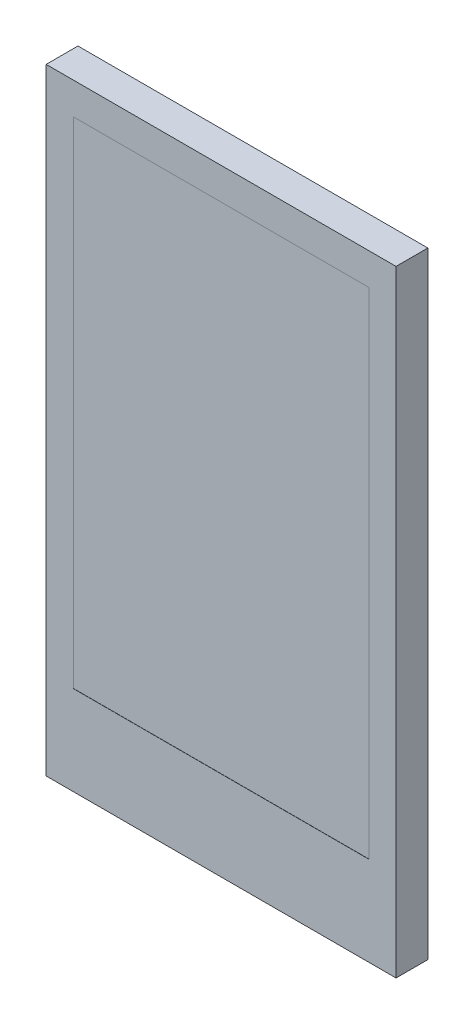
ISO-10303-21;
HEADER;
FILE_DESCRIPTION(('STEP AP214'),'2;1');
FILE_NAME('part.step','',(''),(''),'','','');
FILE_SCHEMA(('AUTOMOTIVE_DESIGN { 1 0 10303 214 1 1 1 1 }'));
ENDSEC;
DATA;
#1=APPLICATION_CONTEXT('core data for automotive mechanical design processes');
#2=APPLICATION_PROTOCOL_DEFINITION('international standard','automotive_design',2000,#1);
#3=PRODUCT_CONTEXT('',#1,'mechanical');
#4=PRODUCT('Part','Part','',(#3));
#5=PRODUCT_RELATED_PRODUCT_CATEGORY('part','',(#4));
#6=PRODUCT_DEFINITION_FORMATION('','',#4);
#7=PRODUCT_DEFINITION_CONTEXT('part definition',#1,'design');
#8=PRODUCT_DEFINITION('design','',#6,#7);
#9=PRODUCT_DEFINITION_SHAPE('','',#8);
#10=(LENGTH_UNIT() NAMED_UNIT(*) SI_UNIT(.MILLI.,.METRE.));
#11=(NAMED_UNIT(*) PLANE_ANGLE_UNIT() SI_UNIT($,.RADIAN.));
#12=(NAMED_UNIT(*) SI_UNIT($,.STERADIAN.) SOLID_ANGLE_UNIT());
#13=UNCERTAINTY_MEASURE_WITH_UNIT(LENGTH_MEASURE(1.E-05),#10,'distance_accuracy_value','');
#14=(GEOMETRIC_REPRESENTATION_CONTEXT(3) GLOBAL_UNCERTAINTY_ASSIGNED_CONTEXT((#13)) GLOBAL_UNIT_ASSIGNED_CONTEXT((#10,
#11,#12)) REPRESENTATION_CONTEXT('',''));
#15=CARTESIAN_POINT('',(0.,0.,0.));
#16=DIRECTION('',(0.,0.,1.));
#17=DIRECTION('',(1.,0.,0.));
#18=AXIS2_PLACEMENT_3D('',#15,#16,#17);
#19=CARTESIAN_POINT('',(-8.8,-15.5,1.6));
#20=DIRECTION('',(1.,0.,0.));
#21=DIRECTION('',(0.,0.,-1.));
#22=AXIS2_PLACEMENT_3D('',#19,#20,#21);
#23=PLANE('',#22);
#24=DIRECTION('',(0.,-1.,0.));
#25=VECTOR('',#24,1.);
#26=CARTESIAN_POINT('',(-8.8,-15.5,0.));
#27=LINE('',#26,#25);
#28=CARTESIAN_POINT('',(-8.8,15.5,0.));
#29=VERTEX_POINT('',#28);
#30=CARTESIAN_POINT('',(-8.8,-15.5,0.));
#31=VERTEX_POINT('',#30);
#32=EDGE_CURVE('E160',#29,#31,#27,.T.);
#33=ORIENTED_EDGE('',*,*,#32,.T.);
#34=DIRECTION('',(0.,0.,-1.));
#35=VECTOR('',#34,1.);
#36=CARTESIAN_POINT('',(-8.8,-15.5,1.6));
#37=LINE('',#36,#35);
#38=CARTESIAN_POINT('',(-8.8,-15.5,1.6));
#39=VERTEX_POINT('',#38);
#40=EDGE_CURVE('E11',#39,#31,#37,.T.);
#41=ORIENTED_EDGE('',*,*,#40,.F.);
#42=DIRECTION('',(0.,-1.,0.));
#43=VECTOR('',#42,1.);
#44=CARTESIAN_POINT('',(-8.8,-15.5,1.6));
#45=LINE('',#44,#43);
#46=CARTESIAN_POINT('',(-8.8,15.5,1.6));
#47=VERTEX_POINT('',#46);
#48=EDGE_CURVE('E166',#47,#39,#45,.T.);
#49=ORIENTED_EDGE('',*,*,#48,.F.);
#50=DIRECTION('',(0.,0.,-1.));
#51=VECTOR('',#50,1.);
#52=CARTESIAN_POINT('',(-8.8,15.5,1.6));
#53=LINE('',#52,#51);
#54=EDGE_CURVE('E176',#47,#29,#53,.T.);
#55=ORIENTED_EDGE('',*,*,#54,.T.);
#56=EDGE_LOOP('',(#33,#41,#49,#55));
#57=FACE_BOUND('',#56,.T.);
#58=ADVANCED_FACE('F41',(#57),#23,.F.);
#59=CARTESIAN_POINT('',(8.8,-15.5,1.6));
#60=DIRECTION('',(0.,1.,0.));
#61=DIRECTION('',(0.,0.,1.));
#62=AXIS2_PLACEMENT_3D('',#59,#60,#61);
#63=PLANE('',#62);
#64=DIRECTION('',(1.,0.,0.));
#65=VECTOR('',#64,1.);
#66=CARTESIAN_POINT('',(8.8,-15.5,0.));
#67=LINE('',#66,#65);
#68=CARTESIAN_POINT('',(8.8,-15.5,0.));
#69=VERTEX_POINT('',#68);
#70=EDGE_CURVE('E180',#31,#69,#67,.T.);
#71=ORIENTED_EDGE('',*,*,#70,.T.);
#72=DIRECTION('',(0.,0.,-1.));
#73=VECTOR('',#72,1.);
#74=CARTESIAN_POINT('',(8.8,-15.5,1.6));
#75=LINE('',#74,#73);
#76=CARTESIAN_POINT('',(8.8,-15.5,1.6));
#77=VERTEX_POINT('',#76);
#78=EDGE_CURVE('E49',#77,#69,#75,.T.);
#79=ORIENTED_EDGE('',*,*,#78,.F.);
#80=DIRECTION('',(1.,0.,0.));
#81=VECTOR('',#80,1.);
#82=CARTESIAN_POINT('',(8.8,-15.5,1.6));
#83=LINE('',#82,#81);
#84=EDGE_CURVE('E93',#39,#77,#83,.T.);
#85=ORIENTED_EDGE('',*,*,#84,.F.);
#86=ORIENTED_EDGE('',*,*,#40,.T.);
#87=EDGE_LOOP('',(#71,#79,#85,#86));
#88=FACE_BOUND('',#87,.T.);
#89=ADVANCED_FACE('F215',(#88),#63,.F.);
#90=CARTESIAN_POINT('',(8.8,-15.5,1.6));
#91=DIRECTION('',(-1.,0.,0.));
#92=DIRECTION('',(0.,0.,1.));
#93=AXIS2_PLACEMENT_3D('',#90,#91,#92);
#94=PLANE('',#93);
#95=DIRECTION('',(0.,1.,0.));
#96=VECTOR('',#95,1.);
#97=CARTESIAN_POINT('',(8.8,-15.5,0.));
#98=LINE('',#97,#96);
#99=CARTESIAN_POINT('',(8.8,15.5,0.));
#100=VERTEX_POINT('',#99);
#101=EDGE_CURVE('E183',#69,#100,#98,.T.);
#102=ORIENTED_EDGE('',*,*,#101,.T.);
#103=DIRECTION('',(0.,0.,-1.));
#104=VECTOR('',#103,1.);
#105=CARTESIAN_POINT('',(8.8,15.5,1.6));
#106=LINE('',#105,#104);
#107=CARTESIAN_POINT('',(8.8,15.5,1.6));
#108=VERTEX_POINT('',#107);
#109=EDGE_CURVE('E190',#108,#100,#106,.T.);
#110=ORIENTED_EDGE('',*,*,#109,.F.);
#111=DIRECTION('',(0.,1.,0.));
#112=VECTOR('',#111,1.);
#113=CARTESIAN_POINT('',(8.8,-15.5,1.6));
#114=LINE('',#113,#112);
#115=EDGE_CURVE('E171',#77,#108,#114,.T.);
#116=ORIENTED_EDGE('',*,*,#115,.F.);
#117=ORIENTED_EDGE('',*,*,#78,.T.);
#118=EDGE_LOOP('',(#102,#110,#116,#117));
#119=FACE_BOUND('',#118,.T.);
#120=ADVANCED_FACE('F197',(#119),#94,.F.);
#121=CARTESIAN_POINT('',(8.8,15.5,1.6));
#122=DIRECTION('',(0.,-1.,0.));
#123=DIRECTION('',(1.,0.,0.));
#124=AXIS2_PLACEMENT_3D('',#121,#122,#123);
#125=PLANE('',#124);
#126=DIRECTION('',(-1.,0.,0.));
#127=VECTOR('',#126,1.);
#128=CARTESIAN_POINT('',(8.8,15.5,0.));
#129=LINE('',#128,#127);
#130=EDGE_CURVE('E86',#100,#29,#129,.T.);
#131=ORIENTED_EDGE('',*,*,#130,.T.);
#132=ORIENTED_EDGE('',*,*,#54,.F.);
#133=DIRECTION('',(-1.,0.,0.));
#134=VECTOR('',#133,1.);
#135=CARTESIAN_POINT('',(8.8,15.5,1.6));
#136=LINE('',#135,#134);
#137=EDGE_CURVE('E65',#108,#47,#136,.T.);
#138=ORIENTED_EDGE('',*,*,#137,.F.);
#139=ORIENTED_EDGE('',*,*,#109,.T.);
#140=EDGE_LOOP('',(#131,#132,#138,#139));
#141=FACE_BOUND('',#140,.T.);
#142=ADVANCED_FACE('F205',(#141),#125,.F.);
#143=CARTESIAN_POINT('',(0.,0.,1.6));
#144=DIRECTION('',(0.,0.,1.));
#145=DIRECTION('',(1.,0.,0.));
#146=AXIS2_PLACEMENT_3D('',#143,#144,#145);
#147=PLANE('',#146);
#148=DIRECTION('',(0.,-1.,0.));
#149=VECTOR('',#148,1.);
#150=CARTESIAN_POINT('',(-7.43,13.9,1.6));
#151=LINE('',#150,#149);
#152=CARTESIAN_POINT('',(-7.43,13.9,1.6));
#153=VERTEX_POINT('',#152);
#154=CARTESIAN_POINT('',(-7.43,-11.01,1.6));
#155=VERTEX_POINT('',#154);
#156=EDGE_CURVE('E56',#153,#155,#151,.T.);
#157=ORIENTED_EDGE('',*,*,#156,.F.);
#158=DIRECTION('',(-1.,0.,0.));
#159=VECTOR('',#158,1.);
#160=CARTESIAN_POINT('',(7.43,13.9,1.6));
#161=LINE('',#160,#159);
#162=CARTESIAN_POINT('',(7.43,13.9,1.6));
#163=VERTEX_POINT('',#162);
#164=EDGE_CURVE('E138',#163,#153,#161,.T.);
#165=ORIENTED_EDGE('',*,*,#164,.F.);
#166=DIRECTION('',(0.,1.,0.));
#167=VECTOR('',#166,1.);
#168=CARTESIAN_POINT('',(7.43,-11.01,1.6));
#169=LINE('',#168,#167);
#170=CARTESIAN_POINT('',(7.43,-11.01,1.6));
#171=VERTEX_POINT('',#170);
#172=EDGE_CURVE('E142',#171,#163,#169,.T.);
#173=ORIENTED_EDGE('',*,*,#172,.F.);
#174=DIRECTION('',(1.,0.,0.));
#175=VECTOR('',#174,1.);
#176=CARTESIAN_POINT('',(-7.43,-11.01,1.6));
#177=LINE('',#176,#175);
#178=EDGE_CURVE('E151',#155,#171,#177,.T.);
#179=ORIENTED_EDGE('',*,*,#178,.F.);
#180=EDGE_LOOP('',(#157,#165,#173,#179));
#181=FACE_BOUND('',#180,.T.);
#182=ORIENTED_EDGE('',*,*,#48,.T.);
#183=ORIENTED_EDGE('',*,*,#84,.T.);
#184=ORIENTED_EDGE('',*,*,#115,.T.);
#185=ORIENTED_EDGE('',*,*,#137,.T.);
#186=EDGE_LOOP('',(#182,#183,#184,#185));
#187=FACE_BOUND('',#186,.T.);
#188=ADVANCED_FACE('F207',(#181,#187),#147,.T.);
#189=CARTESIAN_POINT('',(0.,0.,0.));
#190=DIRECTION('',(0.,0.,1.));
#191=DIRECTION('',(1.,0.,0.));
#192=AXIS2_PLACEMENT_3D('',#189,#190,#191);
#193=PLANE('',#192);
#194=ORIENTED_EDGE('',*,*,#32,.F.);
#195=ORIENTED_EDGE('',*,*,#130,.F.);
#196=ORIENTED_EDGE('',*,*,#101,.F.);
#197=ORIENTED_EDGE('',*,*,#70,.F.);
#198=EDGE_LOOP('',(#194,#195,#196,#197));
#199=FACE_BOUND('',#198,.T.);
#200=ADVANCED_FACE('F201',(#199),#193,.F.);
#201=CARTESIAN_POINT('',(-7.43,13.9,1.59));
#202=DIRECTION('',(-1.,0.,0.));
#203=DIRECTION('',(0.,-1.,0.));
#204=AXIS2_PLACEMENT_3D('',#201,#202,#203);
#205=PLANE('',#204);
#206=ORIENTED_EDGE('',*,*,#156,.T.);
#207=DIRECTION('',(0.,0.,1.));
#208=VECTOR('',#207,1.);
#209=CARTESIAN_POINT('',(-7.43,-11.01,1.59));
#210=LINE('',#209,#208);
#211=CARTESIAN_POINT('',(-7.43,-11.01,1.59));
#212=VERTEX_POINT('',#211);
#213=EDGE_CURVE('E113',#212,#155,#210,.T.);
#214=ORIENTED_EDGE('',*,*,#213,.F.);
#215=DIRECTION('',(0.,-1.,0.));
#216=VECTOR('',#215,1.);
#217=CARTESIAN_POINT('',(-7.43,13.9,1.59));
#218=LINE('',#217,#216);
#219=CARTESIAN_POINT('',(-7.43,13.9,1.59));
#220=VERTEX_POINT('',#219);
#221=EDGE_CURVE('E117',#220,#212,#218,.T.);
#222=ORIENTED_EDGE('',*,*,#221,.F.);
#223=DIRECTION('',(0.,0.,1.));
#224=VECTOR('',#223,1.);
#225=CARTESIAN_POINT('',(-7.43,13.9,1.59));
#226=LINE('',#225,#224);
#227=EDGE_CURVE('E157',#220,#153,#226,.T.);
#228=ORIENTED_EDGE('',*,*,#227,.T.);
#229=EDGE_LOOP('',(#206,#214,#222,#228));
#230=FACE_BOUND('',#229,.T.);
#231=ADVANCED_FACE('F115',(#230),#205,.F.);
#232=CARTESIAN_POINT('',(7.43,13.9,1.59));
#233=DIRECTION('',(0.,1.,0.));
#234=DIRECTION('',(-1.,0.,0.));
#235=AXIS2_PLACEMENT_3D('',#232,#233,#234);
#236=PLANE('',#235);
#237=ORIENTED_EDGE('',*,*,#164,.T.);
#238=ORIENTED_EDGE('',*,*,#227,.F.);
#239=DIRECTION('',(-1.,0.,0.));
#240=VECTOR('',#239,1.);
#241=CARTESIAN_POINT('',(7.43,13.9,1.59));
#242=LINE('',#241,#240);
#243=CARTESIAN_POINT('',(7.43,13.9,1.59));
#244=VERTEX_POINT('',#243);
#245=EDGE_CURVE('E124',#244,#220,#242,.T.);
#246=ORIENTED_EDGE('',*,*,#245,.F.);
#247=DIRECTION('',(0.,0.,1.));
#248=VECTOR('',#247,1.);
#249=CARTESIAN_POINT('',(7.43,13.9,1.59));
#250=LINE('',#249,#248);
#251=EDGE_CURVE('E161',#244,#163,#250,.T.);
#252=ORIENTED_EDGE('',*,*,#251,.T.);
#253=EDGE_LOOP('',(#237,#238,#246,#252));
#254=FACE_BOUND('',#253,.T.);
#255=ADVANCED_FACE('F254',(#254),#236,.F.);
#256=CARTESIAN_POINT('',(7.43,-11.01,1.59));
#257=DIRECTION('',(1.,0.,0.));
#258=DIRECTION('',(0.,0.,-1.));
#259=AXIS2_PLACEMENT_3D('',#256,#257,#258);
#260=PLANE('',#259);
#261=ORIENTED_EDGE('',*,*,#172,.T.);
#262=ORIENTED_EDGE('',*,*,#251,.F.);
#263=DIRECTION('',(0.,1.,0.));
#264=VECTOR('',#263,1.);
#265=CARTESIAN_POINT('',(7.43,-11.01,1.59));
#266=LINE('',#265,#264);
#267=CARTESIAN_POINT('',(7.43,-11.01,1.59));
#268=VERTEX_POINT('',#267);
#269=EDGE_CURVE('E133',#268,#244,#266,.T.);
#270=ORIENTED_EDGE('',*,*,#269,.F.);
#271=DIRECTION('',(0.,0.,1.));
#272=VECTOR('',#271,1.);
#273=CARTESIAN_POINT('',(7.43,-11.01,1.59));
#274=LINE('',#273,#272);
#275=EDGE_CURVE('E123',#268,#171,#274,.T.);
#276=ORIENTED_EDGE('',*,*,#275,.T.);
#277=EDGE_LOOP('',(#261,#262,#270,#276));
#278=FACE_BOUND('',#277,.T.);
#279=ADVANCED_FACE('F263',(#278),#260,.F.);
#280=CARTESIAN_POINT('',(-7.43,-11.01,1.59));
#281=DIRECTION('',(0.,-1.,0.));
#282=DIRECTION('',(0.,0.,-1.));
#283=AXIS2_PLACEMENT_3D('',#280,#281,#282);
#284=PLANE('',#283);
#285=ORIENTED_EDGE('',*,*,#178,.T.);
#286=ORIENTED_EDGE('',*,*,#275,.F.);
#287=DIRECTION('',(1.,0.,0.));
#288=VECTOR('',#287,1.);
#289=CARTESIAN_POINT('',(-7.43,-11.01,1.59));
#290=LINE('',#289,#288);
#291=EDGE_CURVE('E127',#212,#268,#290,.T.);
#292=ORIENTED_EDGE('',*,*,#291,.F.);
#293=ORIENTED_EDGE('',*,*,#213,.T.);
#294=EDGE_LOOP('',(#285,#286,#292,#293));
#295=FACE_BOUND('',#294,.T.);
#296=ADVANCED_FACE('F128',(#295),#284,.F.);
#297=CARTESIAN_POINT('',(0.,0.,1.59));
#298=DIRECTION('',(0.,0.,1.));
#299=DIRECTION('',(1.,0.,0.));
#300=AXIS2_PLACEMENT_3D('',#297,#298,#299);
#301=PLANE('',#300);
#302=ORIENTED_EDGE('',*,*,#221,.T.);
#303=ORIENTED_EDGE('',*,*,#291,.T.);
#304=ORIENTED_EDGE('',*,*,#269,.T.);
#305=ORIENTED_EDGE('',*,*,#245,.T.);
#306=EDGE_LOOP('',(#302,#303,#304,#305));
#307=FACE_BOUND('',#306,.T.);
#308=ADVANCED_FACE('F135',(#307),#301,.T.);
#309=CLOSED_SHELL('',(#58,#89,#120,#142,#188,#200,#231,#255,#279,#296,#308));
#310=MANIFOLD_SOLID_BREP('B2',#309);
#311=ADVANCED_BREP_SHAPE_REPRESENTATION('',(#18,#310),#14);
#312=SHAPE_DEFINITION_REPRESENTATION(#9,#311);
ENDSEC;
END-ISO-10303-21;
